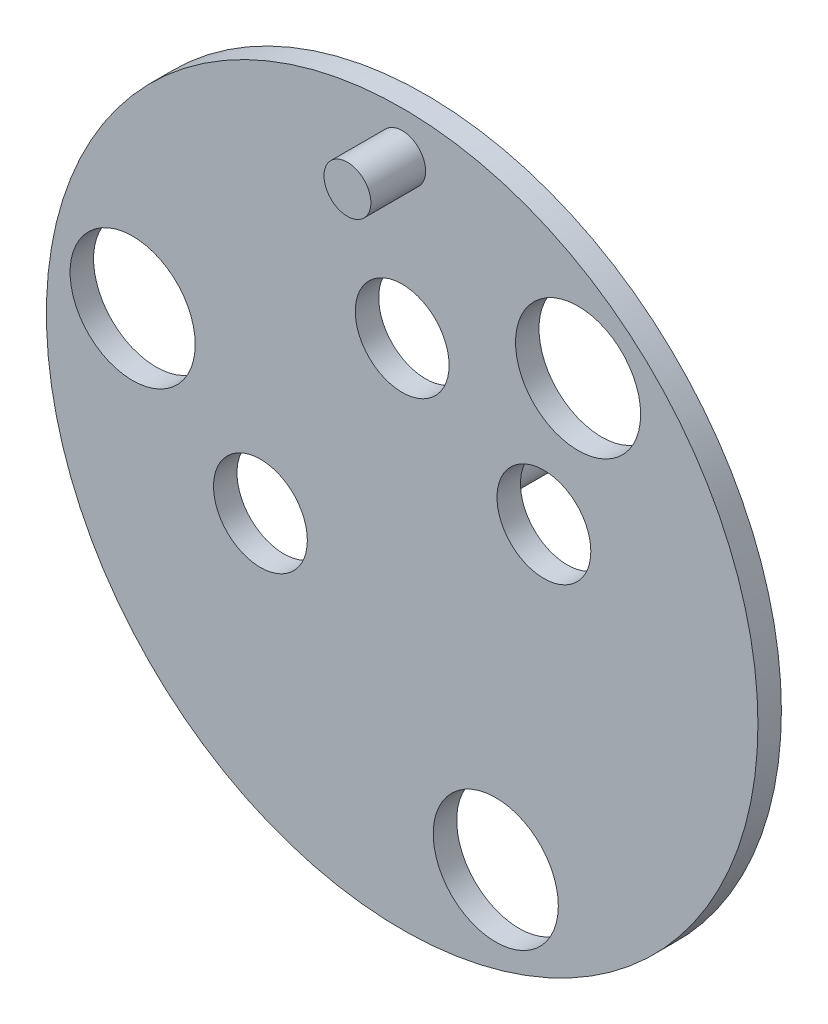
ISO-10303-21;
HEADER;
FILE_DESCRIPTION(('STEP AP214'),'2;1');
FILE_NAME('part.step','',(''),(''),'','','');
FILE_SCHEMA(('AUTOMOTIVE_DESIGN { 1 0 10303 214 1 1 1 1 }'));
ENDSEC;
DATA;
#1=APPLICATION_CONTEXT('core data for automotive mechanical design processes');
#2=APPLICATION_PROTOCOL_DEFINITION('international standard','automotive_design',2000,#1);
#3=PRODUCT_CONTEXT('',#1,'mechanical');
#4=PRODUCT('Part','Part','',(#3));
#5=PRODUCT_RELATED_PRODUCT_CATEGORY('part','',(#4));
#6=PRODUCT_DEFINITION_FORMATION('','',#4);
#7=PRODUCT_DEFINITION_CONTEXT('part definition',#1,'design');
#8=PRODUCT_DEFINITION('design','',#6,#7);
#9=PRODUCT_DEFINITION_SHAPE('','',#8);
#10=(LENGTH_UNIT() NAMED_UNIT(*) SI_UNIT(.MILLI.,.METRE.));
#11=(NAMED_UNIT(*) PLANE_ANGLE_UNIT() SI_UNIT($,.RADIAN.));
#12=(NAMED_UNIT(*) SI_UNIT($,.STERADIAN.) SOLID_ANGLE_UNIT());
#13=UNCERTAINTY_MEASURE_WITH_UNIT(LENGTH_MEASURE(1.E-05),#10,'distance_accuracy_value','');
#14=(GEOMETRIC_REPRESENTATION_CONTEXT(3) GLOBAL_UNCERTAINTY_ASSIGNED_CONTEXT((#13)) GLOBAL_UNIT_ASSIGNED_CONTEXT((#10,
#11,#12)) REPRESENTATION_CONTEXT('',''));
#15=CARTESIAN_POINT('',(0.,0.,0.));
#16=DIRECTION('',(0.,0.,1.));
#17=DIRECTION('',(1.,0.,0.));
#18=AXIS2_PLACEMENT_3D('',#15,#16,#17);
#19=CARTESIAN_POINT('',(0.,0.,7.5));
#20=DIRECTION('',(0.,0.,-1.));
#21=DIRECTION('',(-1.,0.,0.));
#22=AXIS2_PLACEMENT_3D('',#19,#20,#21);
#23=CYLINDRICAL_SURFACE('',#22,227.5);
#24=CARTESIAN_POINT('',(0.,0.,7.5));
#25=DIRECTION('',(0.,0.,1.));
#26=DIRECTION('',(1.,0.,0.));
#27=AXIS2_PLACEMENT_3D('',#24,#25,#26);
#28=CIRCLE('',#27,227.5);
#29=CARTESIAN_POINT('',(227.5,0.,7.5));
#30=VERTEX_POINT('',#29);
#31=EDGE_CURVE('E10',#30,#30,#28,.T.);
#32=ORIENTED_EDGE('',*,*,#31,.F.);
#33=EDGE_LOOP('',(#32));
#34=FACE_BOUND('',#33,.T.);
#35=CARTESIAN_POINT('',(0.,0.,-7.5));
#36=DIRECTION('',(0.,0.,1.));
#37=DIRECTION('',(1.,0.,0.));
#38=AXIS2_PLACEMENT_3D('',#35,#36,#37);
#39=CIRCLE('',#38,227.5);
#40=CARTESIAN_POINT('',(227.5,0.,-7.5));
#41=VERTEX_POINT('',#40);
#42=EDGE_CURVE('E40',#41,#41,#39,.T.);
#43=ORIENTED_EDGE('',*,*,#42,.T.);
#44=EDGE_LOOP('',(#43));
#45=FACE_BOUND('',#44,.T.);
#46=ADVANCED_FACE('F37',(#34,#45),#23,.T.);
#47=CARTESIAN_POINT('',(0.,0.,7.5));
#48=DIRECTION('',(0.,0.,1.));
#49=DIRECTION('',(1.,0.,0.));
#50=AXIS2_PLACEMENT_3D('',#47,#48,#49);
#51=PLANE('',#50);
#52=CARTESIAN_POINT('',(-172.341356777136,30.3884310917135,7.5));
#53=DIRECTION('',(0.,0.,1.));
#54=DIRECTION('',(1.,0.,0.));
#55=AXIS2_PLACEMENT_3D('',#52,#53,#54);
#56=CIRCLE('',#55,40.);
#57=CARTESIAN_POINT('',(-132.341356777136,30.3884310917135,7.5));
#58=VERTEX_POINT('',#57);
#59=EDGE_CURVE('E86',#58,#58,#56,.T.);
#60=ORIENTED_EDGE('',*,*,#59,.F.);
#61=EDGE_LOOP('',(#60));
#62=FACE_BOUND('',#61,.T.);
#63=CARTESIAN_POINT('',(0.,100.,7.5));
#64=DIRECTION('',(0.,0.,1.));
#65=DIRECTION('',(1.,0.,0.));
#66=AXIS2_PLACEMENT_3D('',#63,#64,#65);
#67=CIRCLE('',#66,30.);
#68=CARTESIAN_POINT('',(30.,100.,7.5));
#69=VERTEX_POINT('',#68);
#70=EDGE_CURVE('E80',#69,#69,#67,.T.);
#71=ORIENTED_EDGE('',*,*,#70,.F.);
#72=EDGE_LOOP('',(#71));
#73=FACE_BOUND('',#72,.T.);
#74=CARTESIAN_POINT('',(-90.6307787036648,-42.2618261740704,7.5));
#75=DIRECTION('',(0.,0.,1.));
#76=DIRECTION('',(1.,0.,0.));
#77=AXIS2_PLACEMENT_3D('',#74,#75,#76);
#78=CIRCLE('',#77,30.);
#79=CARTESIAN_POINT('',(-60.6307787036648,-42.2618261740704,7.5));
#80=VERTEX_POINT('',#79);
#81=EDGE_CURVE('E74',#80,#80,#78,.T.);
#82=ORIENTED_EDGE('',*,*,#81,.F.);
#83=EDGE_LOOP('',(#82));
#84=FACE_BOUND('',#83,.T.);
#85=CARTESIAN_POINT('',(90.6307787036648,42.2618261740704,7.5));
#86=DIRECTION('',(0.,0.,1.));
#87=DIRECTION('',(1.,0.,0.));
#88=AXIS2_PLACEMENT_3D('',#85,#86,#87);
#89=CIRCLE('',#88,29.9999999999999);
#90=CARTESIAN_POINT('',(120.630778703665,42.2618261740704,7.5));
#91=VERTEX_POINT('',#90);
#92=EDGE_CURVE('E68',#91,#91,#89,.T.);
#93=ORIENTED_EDGE('',*,*,#92,.F.);
#94=EDGE_LOOP('',(#93));
#95=FACE_BOUND('',#94,.T.);
#96=CARTESIAN_POINT('',(112.487831695139,134.057777545837,7.5));
#97=DIRECTION('',(0.,0.,1.));
#98=DIRECTION('',(1.,0.,0.));
#99=AXIS2_PLACEMENT_3D('',#96,#97,#98);
#100=CIRCLE('',#99,40.0000000000148);
#101=CARTESIAN_POINT('',(152.487831695154,134.057777545837,7.5));
#102=VERTEX_POINT('',#101);
#103=EDGE_CURVE('E62',#102,#102,#100,.T.);
#104=ORIENTED_EDGE('',*,*,#103,.F.);
#105=EDGE_LOOP('',(#104));
#106=FACE_BOUND('',#105,.T.);
#107=CARTESIAN_POINT('',(59.8535250820026,-164.446208637521,7.5));
#108=DIRECTION('',(0.,0.,1.));
#109=DIRECTION('',(1.,0.,0.));
#110=AXIS2_PLACEMENT_3D('',#107,#108,#109);
#111=CIRCLE('',#110,40.);
#112=CARTESIAN_POINT('',(99.8535250820026,-164.446208637521,7.5));
#113=VERTEX_POINT('',#112);
#114=EDGE_CURVE('E55',#113,#113,#111,.T.);
#115=ORIENTED_EDGE('',*,*,#114,.F.);
#116=EDGE_LOOP('',(#115));
#117=FACE_BOUND('',#116,.T.);
#118=CARTESIAN_POINT('',(0.,200.,7.5));
#119=DIRECTION('',(0.,0.,1.));
#120=DIRECTION('',(1.,0.,0.));
#121=AXIS2_PLACEMENT_3D('',#118,#119,#120);
#122=CIRCLE('',#121,15.);
#123=CARTESIAN_POINT('',(15.,200.,7.5));
#124=VERTEX_POINT('',#123);
#125=EDGE_CURVE('E51',#124,#124,#122,.T.);
#126=ORIENTED_EDGE('',*,*,#125,.F.);
#127=EDGE_LOOP('',(#126));
#128=FACE_BOUND('',#127,.T.);
#129=ORIENTED_EDGE('',*,*,#31,.T.);
#130=EDGE_LOOP('',(#129));
#131=FACE_BOUND('',#130,.T.);
#132=ADVANCED_FACE('F109',(#62,#73,#84,#95,#106,#117,#128,#131),#51,.T.);
#133=CARTESIAN_POINT('',(0.,0.,-7.5));
#134=DIRECTION('',(0.,0.,1.));
#135=DIRECTION('',(1.,0.,0.));
#136=AXIS2_PLACEMENT_3D('',#133,#134,#135);
#137=PLANE('',#136);
#138=CARTESIAN_POINT('',(0.,0.,-7.5));
#139=DIRECTION('',(0.,0.,1.));
#140=DIRECTION('',(1.,0.,0.));
#141=AXIS2_PLACEMENT_3D('',#138,#139,#140);
#142=CIRCLE('',#141,15.);
#143=CARTESIAN_POINT('',(15.,0.,-7.5));
#144=VERTEX_POINT('',#143);
#145=EDGE_CURVE('E91',#144,#144,#142,.T.);
#146=ORIENTED_EDGE('',*,*,#145,.T.);
#147=EDGE_LOOP('',(#146));
#148=FACE_BOUND('',#147,.T.);
#149=CARTESIAN_POINT('',(-172.341356777136,30.3884310917135,-7.5));
#150=DIRECTION('',(0.,0.,1.));
#151=DIRECTION('',(1.,0.,0.));
#152=AXIS2_PLACEMENT_3D('',#149,#150,#151);
#153=CIRCLE('',#152,40.);
#154=CARTESIAN_POINT('',(-132.341356777136,30.3884310917135,-7.5));
#155=VERTEX_POINT('',#154);
#156=EDGE_CURVE('E54',#155,#155,#153,.T.);
#157=ORIENTED_EDGE('',*,*,#156,.T.);
#158=EDGE_LOOP('',(#157));
#159=FACE_BOUND('',#158,.T.);
#160=CARTESIAN_POINT('',(0.,100.,-7.5));
#161=DIRECTION('',(0.,0.,1.));
#162=DIRECTION('',(1.,0.,0.));
#163=AXIS2_PLACEMENT_3D('',#160,#161,#162);
#164=CIRCLE('',#163,30.);
#165=CARTESIAN_POINT('',(30.,100.,-7.5));
#166=VERTEX_POINT('',#165);
#167=EDGE_CURVE('E83',#166,#166,#164,.T.);
#168=ORIENTED_EDGE('',*,*,#167,.T.);
#169=EDGE_LOOP('',(#168));
#170=FACE_BOUND('',#169,.T.);
#171=CARTESIAN_POINT('',(-90.6307787036648,-42.2618261740704,-7.5));
#172=DIRECTION('',(0.,0.,1.));
#173=DIRECTION('',(1.,0.,0.));
#174=AXIS2_PLACEMENT_3D('',#171,#172,#173);
#175=CIRCLE('',#174,30.);
#176=CARTESIAN_POINT('',(-60.6307787036648,-42.2618261740704,-7.5));
#177=VERTEX_POINT('',#176);
#178=EDGE_CURVE('E77',#177,#177,#175,.T.);
#179=ORIENTED_EDGE('',*,*,#178,.T.);
#180=EDGE_LOOP('',(#179));
#181=FACE_BOUND('',#180,.T.);
#182=CARTESIAN_POINT('',(90.6307787036648,42.2618261740704,-7.5));
#183=DIRECTION('',(0.,0.,1.));
#184=DIRECTION('',(1.,0.,0.));
#185=AXIS2_PLACEMENT_3D('',#182,#183,#184);
#186=CIRCLE('',#185,29.9999999999999);
#187=CARTESIAN_POINT('',(120.630778703665,42.2618261740704,-7.5));
#188=VERTEX_POINT('',#187);
#189=EDGE_CURVE('E71',#188,#188,#186,.T.);
#190=ORIENTED_EDGE('',*,*,#189,.T.);
#191=EDGE_LOOP('',(#190));
#192=FACE_BOUND('',#191,.T.);
#193=CARTESIAN_POINT('',(112.487831695139,134.057777545837,-7.5));
#194=DIRECTION('',(0.,0.,1.));
#195=DIRECTION('',(1.,0.,0.));
#196=AXIS2_PLACEMENT_3D('',#193,#194,#195);
#197=CIRCLE('',#196,40.0000000000148);
#198=CARTESIAN_POINT('',(152.487831695154,134.057777545837,-7.5));
#199=VERTEX_POINT('',#198);
#200=EDGE_CURVE('E65',#199,#199,#197,.T.);
#201=ORIENTED_EDGE('',*,*,#200,.T.);
#202=EDGE_LOOP('',(#201));
#203=FACE_BOUND('',#202,.T.);
#204=CARTESIAN_POINT('',(59.8535250820026,-164.446208637521,-7.5));
#205=DIRECTION('',(0.,0.,1.));
#206=DIRECTION('',(1.,0.,0.));
#207=AXIS2_PLACEMENT_3D('',#204,#205,#206);
#208=CIRCLE('',#207,40.);
#209=CARTESIAN_POINT('',(99.8535250820026,-164.446208637521,-7.5));
#210=VERTEX_POINT('',#209);
#211=EDGE_CURVE('E58',#210,#210,#208,.T.);
#212=ORIENTED_EDGE('',*,*,#211,.T.);
#213=EDGE_LOOP('',(#212));
#214=FACE_BOUND('',#213,.T.);
#215=ORIENTED_EDGE('',*,*,#42,.F.);
#216=EDGE_LOOP('',(#215));
#217=FACE_BOUND('',#216,.T.);
#218=ADVANCED_FACE('F114',(#148,#159,#170,#181,#192,#203,#214,#217),#137,.F.);
#219=CARTESIAN_POINT('',(0.,200.,84.926406871193));
#220=DIRECTION('',(0.,0.,-1.));
#221=DIRECTION('',(-1.,0.,0.));
#222=AXIS2_PLACEMENT_3D('',#219,#220,#221);
#223=CYLINDRICAL_SURFACE('',#222,15.);
#224=ORIENTED_EDGE('',*,*,#125,.T.);
#225=EDGE_LOOP('',(#224));
#226=FACE_BOUND('',#225,.T.);
#227=CARTESIAN_POINT('',(0.,200.,42.5000000000001));
#228=DIRECTION('',(0.,0.,1.));
#229=DIRECTION('',(1.,0.,0.));
#230=AXIS2_PLACEMENT_3D('',#227,#228,#229);
#231=CIRCLE('',#230,15.);
#232=CARTESIAN_POINT('',(15.,200.,42.5000000000002));
#233=VERTEX_POINT('',#232);
#234=EDGE_CURVE('E47',#233,#233,#231,.T.);
#235=ORIENTED_EDGE('',*,*,#234,.F.);
#236=EDGE_LOOP('',(#235));
#237=FACE_BOUND('',#236,.T.);
#238=ADVANCED_FACE('F121',(#226,#237),#223,.T.);
#239=CARTESIAN_POINT('',(95.6381200073658,360.015810235705,42.5000000000004));
#240=DIRECTION('',(0.,0.,1.));
#241=DIRECTION('',(-0.513030214988877,-0.858370548486181,0.));
#242=AXIS2_PLACEMENT_3D('',#239,#240,#241);
#243=PLANE('',#242);
#244=ORIENTED_EDGE('',*,*,#234,.T.);
#245=EDGE_LOOP('',(#244));
#246=FACE_BOUND('',#245,.T.);
#247=ADVANCED_FACE('F126',(#246),#243,.T.);
#248=CARTESIAN_POINT('',(59.8535250820026,-164.446208637521,-7.5));
#249=DIRECTION('',(0.,0.,1.));
#250=DIRECTION('',(1.,0.,0.));
#251=AXIS2_PLACEMENT_3D('',#248,#249,#250);
#252=CYLINDRICAL_SURFACE('',#251,40.);
#253=ORIENTED_EDGE('',*,*,#211,.F.);
#254=EDGE_LOOP('',(#253));
#255=FACE_BOUND('',#254,.T.);
#256=ORIENTED_EDGE('',*,*,#114,.T.);
#257=EDGE_LOOP('',(#256));
#258=FACE_BOUND('',#257,.T.);
#259=ADVANCED_FACE('F132',(#255,#258),#252,.F.);
#260=CARTESIAN_POINT('',(112.487831695139,134.057777545837,-7.5));
#261=DIRECTION('',(0.,0.,1.));
#262=DIRECTION('',(1.,0.,0.));
#263=AXIS2_PLACEMENT_3D('',#260,#261,#262);
#264=CYLINDRICAL_SURFACE('',#263,40.0000000000148);
#265=ORIENTED_EDGE('',*,*,#200,.F.);
#266=EDGE_LOOP('',(#265));
#267=FACE_BOUND('',#266,.T.);
#268=ORIENTED_EDGE('',*,*,#103,.T.);
#269=EDGE_LOOP('',(#268));
#270=FACE_BOUND('',#269,.T.);
#271=ADVANCED_FACE('F137',(#267,#270),#264,.F.);
#272=CARTESIAN_POINT('',(90.6307787036648,42.2618261740704,-7.5));
#273=DIRECTION('',(0.,0.,1.));
#274=DIRECTION('',(1.,0.,0.));
#275=AXIS2_PLACEMENT_3D('',#272,#273,#274);
#276=CYLINDRICAL_SURFACE('',#275,29.9999999999999);
#277=ORIENTED_EDGE('',*,*,#189,.F.);
#278=EDGE_LOOP('',(#277));
#279=FACE_BOUND('',#278,.T.);
#280=ORIENTED_EDGE('',*,*,#92,.T.);
#281=EDGE_LOOP('',(#280));
#282=FACE_BOUND('',#281,.T.);
#283=ADVANCED_FACE('F141',(#279,#282),#276,.F.);
#284=CARTESIAN_POINT('',(-90.6307787036648,-42.2618261740704,-7.5));
#285=DIRECTION('',(0.,0.,1.));
#286=DIRECTION('',(1.,0.,0.));
#287=AXIS2_PLACEMENT_3D('',#284,#285,#286);
#288=CYLINDRICAL_SURFACE('',#287,30.);
#289=ORIENTED_EDGE('',*,*,#178,.F.);
#290=EDGE_LOOP('',(#289));
#291=FACE_BOUND('',#290,.T.);
#292=ORIENTED_EDGE('',*,*,#81,.T.);
#293=EDGE_LOOP('',(#292));
#294=FACE_BOUND('',#293,.T.);
#295=ADVANCED_FACE('F145',(#291,#294),#288,.F.);
#296=CARTESIAN_POINT('',(0.,100.,-7.5));
#297=DIRECTION('',(0.,0.,1.));
#298=DIRECTION('',(1.,0.,0.));
#299=AXIS2_PLACEMENT_3D('',#296,#297,#298);
#300=CYLINDRICAL_SURFACE('',#299,30.);
#301=ORIENTED_EDGE('',*,*,#167,.F.);
#302=EDGE_LOOP('',(#301));
#303=FACE_BOUND('',#302,.T.);
#304=ORIENTED_EDGE('',*,*,#70,.T.);
#305=EDGE_LOOP('',(#304));
#306=FACE_BOUND('',#305,.T.);
#307=ADVANCED_FACE('F149',(#303,#306),#300,.F.);
#308=CARTESIAN_POINT('',(-172.341356777136,30.3884310917135,-7.5));
#309=DIRECTION('',(0.,0.,1.));
#310=DIRECTION('',(1.,0.,0.));
#311=AXIS2_PLACEMENT_3D('',#308,#309,#310);
#312=CYLINDRICAL_SURFACE('',#311,40.);
#313=ORIENTED_EDGE('',*,*,#156,.F.);
#314=EDGE_LOOP('',(#313));
#315=FACE_BOUND('',#314,.T.);
#316=ORIENTED_EDGE('',*,*,#59,.T.);
#317=EDGE_LOOP('',(#316));
#318=FACE_BOUND('',#317,.T.);
#319=ADVANCED_FACE('F106',(#315,#318),#312,.F.);
#320=CARTESIAN_POINT('',(0.,0.,-82.3279545888296));
#321=DIRECTION('',(0.,0.,1.));
#322=DIRECTION('',(1.,0.,0.));
#323=AXIS2_PLACEMENT_3D('',#320,#321,#322);
#324=CYLINDRICAL_SURFACE('',#323,15.);
#325=CARTESIAN_POINT('',(0.,0.,-82.3279545888296));
#326=DIRECTION('',(0.,0.,1.));
#327=DIRECTION('',(1.,0.,0.));
#328=AXIS2_PLACEMENT_3D('',#325,#326,#327);
#329=CIRCLE('',#328,15.);
#330=CARTESIAN_POINT('',(15.,0.,-82.3279545888296));
#331=VERTEX_POINT('',#330);
#332=EDGE_CURVE('E59',#331,#331,#329,.T.);
#333=ORIENTED_EDGE('',*,*,#332,.T.);
#334=EDGE_LOOP('',(#333));
#335=FACE_BOUND('',#334,.T.);
#336=ORIENTED_EDGE('',*,*,#145,.F.);
#337=EDGE_LOOP('',(#336));
#338=FACE_BOUND('',#337,.T.);
#339=ADVANCED_FACE('F97',(#335,#338),#324,.T.);
#340=CARTESIAN_POINT('',(0.,0.,-82.3279545888296));
#341=DIRECTION('',(0.,0.,1.));
#342=DIRECTION('',(1.,0.,0.));
#343=AXIS2_PLACEMENT_3D('',#340,#341,#342);
#344=PLANE('',#343);
#345=ORIENTED_EDGE('',*,*,#332,.F.);
#346=EDGE_LOOP('',(#345));
#347=FACE_BOUND('',#346,.T.);
#348=ADVANCED_FACE('F100',(#347),#344,.F.);
#349=CLOSED_SHELL('',(#46,#132,#218,#238,#247,#259,#271,#283,#295,#307,#319,#339,#348));
#350=MANIFOLD_SOLID_BREP('B2',#349);
#351=ADVANCED_BREP_SHAPE_REPRESENTATION('',(#18,#350),#14);
#352=SHAPE_DEFINITION_REPRESENTATION(#9,#351);
ENDSEC;
END-ISO-10303-21;
